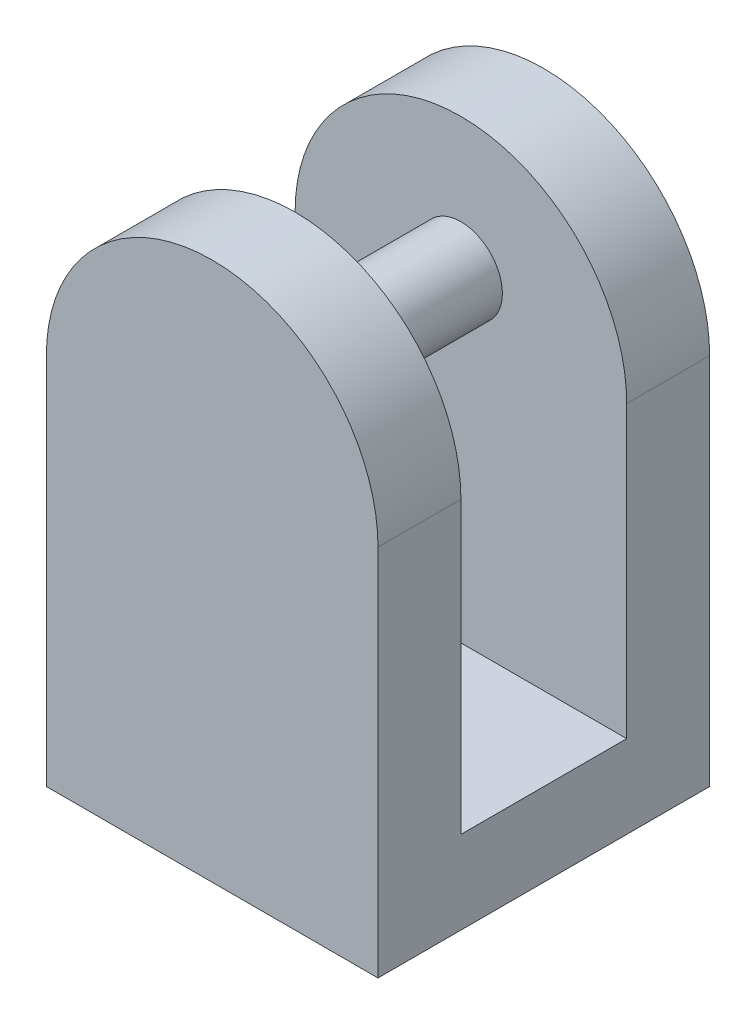
ISO-10303-21;
HEADER;
FILE_DESCRIPTION(('STEP AP214'),'2;1');
FILE_NAME('part.step','',(''),(''),'','','');
FILE_SCHEMA(('AUTOMOTIVE_DESIGN { 1 0 10303 214 1 1 1 1 }'));
ENDSEC;
DATA;
#1=APPLICATION_CONTEXT('core data for automotive mechanical design processes');
#2=APPLICATION_PROTOCOL_DEFINITION('international standard','automotive_design',2000,#1);
#3=PRODUCT_CONTEXT('',#1,'mechanical');
#4=PRODUCT('Part','Part','',(#3));
#5=PRODUCT_RELATED_PRODUCT_CATEGORY('part','',(#4));
#6=PRODUCT_DEFINITION_FORMATION('','',#4);
#7=PRODUCT_DEFINITION_CONTEXT('part definition',#1,'design');
#8=PRODUCT_DEFINITION('design','',#6,#7);
#9=PRODUCT_DEFINITION_SHAPE('','',#8);
#10=(LENGTH_UNIT() NAMED_UNIT(*) SI_UNIT(.MILLI.,.METRE.));
#11=(NAMED_UNIT(*) PLANE_ANGLE_UNIT() SI_UNIT($,.RADIAN.));
#12=(NAMED_UNIT(*) SI_UNIT($,.STERADIAN.) SOLID_ANGLE_UNIT());
#13=UNCERTAINTY_MEASURE_WITH_UNIT(LENGTH_MEASURE(1.E-05),#10,'distance_accuracy_value','');
#14=(GEOMETRIC_REPRESENTATION_CONTEXT(3) GLOBAL_UNCERTAINTY_ASSIGNED_CONTEXT((#13)) GLOBAL_UNIT_ASSIGNED_CONTEXT((#10,
#11,#12)) REPRESENTATION_CONTEXT('',''));
#15=CARTESIAN_POINT('',(0.,0.,0.));
#16=DIRECTION('',(0.,0.,1.));
#17=DIRECTION('',(1.,0.,0.));
#18=AXIS2_PLACEMENT_3D('',#15,#16,#17);
#19=CARTESIAN_POINT('',(0.,-5.,0.));
#20=DIRECTION('',(0.,1.,0.));
#21=DIRECTION('',(0.,0.,1.));
#22=AXIS2_PLACEMENT_3D('',#19,#20,#21);
#23=CYLINDRICAL_SURFACE('',#22,1.25);
#24=CARTESIAN_POINT('',(0.,0.,0.));
#25=DIRECTION('',(0.,1.,0.));
#26=DIRECTION('',(0.,0.,1.));
#27=AXIS2_PLACEMENT_3D('',#24,#25,#26);
#28=CIRCLE('',#27,1.25);
#29=CARTESIAN_POINT('',(0.,0.,1.25));
#30=VERTEX_POINT('',#29);
#31=EDGE_CURVE('E132',#30,#30,#28,.T.);
#32=ORIENTED_EDGE('',*,*,#31,.F.);
#33=EDGE_LOOP('',(#32));
#34=FACE_BOUND('',#33,.T.);
#35=CARTESIAN_POINT('',(0.,3.75,0.));
#36=DIRECTION('',(0.,1.,0.));
#37=DIRECTION('',(0.,0.,1.));
#38=AXIS2_PLACEMENT_3D('',#35,#36,#37);
#39=CIRCLE('',#38,1.25);
#40=CARTESIAN_POINT('',(0.,3.75,1.25));
#41=VERTEX_POINT('',#40);
#42=EDGE_CURVE('E43',#41,#41,#39,.F.);
#43=ORIENTED_EDGE('',*,*,#42,.F.);
#44=EDGE_LOOP('',(#43));
#45=FACE_BOUND('',#44,.T.);
#46=ADVANCED_FACE('F39',(#34,#45),#23,.F.);
#47=CARTESIAN_POINT('',(0.,22.5,10.));
#48=DIRECTION('',(0.,0.,-1.));
#49=DIRECTION('',(-1.,0.,0.));
#50=AXIS2_PLACEMENT_3D('',#47,#48,#49);
#51=CYLINDRICAL_SURFACE('',#50,10.);
#52=DIRECTION('',(0.,0.,-1.));
#53=VECTOR('',#52,1.);
#54=CARTESIAN_POINT('',(-10.,22.5,10.));
#55=LINE('',#54,#53);
#56=CARTESIAN_POINT('',(-10.,22.5,-5.));
#57=VERTEX_POINT('',#56);
#58=CARTESIAN_POINT('',(-10.,22.5,-10.));
#59=VERTEX_POINT('',#58);
#60=EDGE_CURVE('E179',#57,#59,#55,.T.);
#61=ORIENTED_EDGE('',*,*,#60,.F.);
#62=CARTESIAN_POINT('',(0.,22.5,-5.));
#63=DIRECTION('',(0.,0.,-1.));
#64=DIRECTION('',(-1.,0.,0.));
#65=AXIS2_PLACEMENT_3D('',#62,#63,#64);
#66=CIRCLE('',#65,10.);
#67=CARTESIAN_POINT('',(10.,22.5,-5.));
#68=VERTEX_POINT('',#67);
#69=EDGE_CURVE('E146',#57,#68,#66,.T.);
#70=ORIENTED_EDGE('',*,*,#69,.T.);
#71=DIRECTION('',(0.,0.,-1.));
#72=VECTOR('',#71,1.);
#73=CARTESIAN_POINT('',(9.99999999999999,22.5,10.));
#74=LINE('',#73,#72);
#75=CARTESIAN_POINT('',(9.99999999999999,22.5,-10.));
#76=VERTEX_POINT('',#75);
#77=EDGE_CURVE('E136',#68,#76,#74,.T.);
#78=ORIENTED_EDGE('',*,*,#77,.T.);
#79=CARTESIAN_POINT('',(0.,22.5,-10.));
#80=DIRECTION('',(0.,0.,1.));
#81=DIRECTION('',(-1.,0.,0.));
#82=AXIS2_PLACEMENT_3D('',#79,#80,#81);
#83=CIRCLE('',#82,10.);
#84=EDGE_CURVE('E171',#76,#59,#83,.T.);
#85=ORIENTED_EDGE('',*,*,#84,.T.);
#86=EDGE_LOOP('',(#61,#70,#78,#85));
#87=FACE_BOUND('',#86,.T.);
#88=ADVANCED_FACE('F211',(#87),#51,.T.);
#89=CARTESIAN_POINT('',(-10.,0.,10.));
#90=DIRECTION('',(0.,1.,0.));
#91=DIRECTION('',(0.,0.,1.));
#92=AXIS2_PLACEMENT_3D('',#89,#90,#91);
#93=PLANE('',#92);
#94=ORIENTED_EDGE('',*,*,#31,.T.);
#95=EDGE_LOOP('',(#94));
#96=FACE_BOUND('',#95,.T.);
#97=DIRECTION('',(1.,0.,0.));
#98=VECTOR('',#97,1.);
#99=CARTESIAN_POINT('',(-10.,0.,-10.));
#100=LINE('',#99,#98);
#101=CARTESIAN_POINT('',(-10.,0.,-10.));
#102=VERTEX_POINT('',#101);
#103=CARTESIAN_POINT('',(10.,0.,-10.));
#104=VERTEX_POINT('',#103);
#105=EDGE_CURVE('E153',#102,#104,#100,.T.);
#106=ORIENTED_EDGE('',*,*,#105,.T.);
#107=DIRECTION('',(0.,0.,-1.));
#108=VECTOR('',#107,1.);
#109=CARTESIAN_POINT('',(10.,0.,10.));
#110=LINE('',#109,#108);
#111=CARTESIAN_POINT('',(10.,0.,10.));
#112=VERTEX_POINT('',#111);
#113=EDGE_CURVE('E188',#112,#104,#110,.T.);
#114=ORIENTED_EDGE('',*,*,#113,.F.);
#115=DIRECTION('',(1.,0.,0.));
#116=VECTOR('',#115,1.);
#117=CARTESIAN_POINT('',(-10.,0.,10.));
#118=LINE('',#117,#116);
#119=CARTESIAN_POINT('',(-10.,0.,10.));
#120=VERTEX_POINT('',#119);
#121=EDGE_CURVE('E154',#120,#112,#118,.T.);
#122=ORIENTED_EDGE('',*,*,#121,.F.);
#123=DIRECTION('',(0.,0.,-1.));
#124=VECTOR('',#123,1.);
#125=CARTESIAN_POINT('',(-10.,0.,10.));
#126=LINE('',#125,#124);
#127=EDGE_CURVE('E164',#120,#102,#126,.T.);
#128=ORIENTED_EDGE('',*,*,#127,.T.);
#129=EDGE_LOOP('',(#106,#114,#122,#128));
#130=FACE_BOUND('',#129,.T.);
#131=ADVANCED_FACE('F41',(#96,#130),#93,.F.);
#132=CARTESIAN_POINT('',(10.,0.,10.));
#133=DIRECTION('',(-1.,0.,0.));
#134=DIRECTION('',(0.,-1.,0.));
#135=AXIS2_PLACEMENT_3D('',#132,#133,#134);
#136=PLANE('',#135);
#137=DIRECTION('',(0.,0.,-1.));
#138=VECTOR('',#137,1.);
#139=CARTESIAN_POINT('',(10.,5.,5.));
#140=LINE('',#139,#138);
#141=CARTESIAN_POINT('',(10.,5.,5.));
#142=VERTEX_POINT('',#141);
#143=CARTESIAN_POINT('',(10.,5.,-5.));
#144=VERTEX_POINT('',#143);
#145=EDGE_CURVE('E123',#142,#144,#140,.T.);
#146=ORIENTED_EDGE('',*,*,#145,.F.);
#147=DIRECTION('',(0.,1.,0.));
#148=VECTOR('',#147,1.);
#149=CARTESIAN_POINT('',(10.,5.,5.));
#150=LINE('',#149,#148);
#151=CARTESIAN_POINT('',(10.,22.5,5.));
#152=VERTEX_POINT('',#151);
#153=EDGE_CURVE('E150',#142,#152,#150,.T.);
#154=ORIENTED_EDGE('',*,*,#153,.T.);
#155=CARTESIAN_POINT('',(9.99999999999999,22.5,10.));
#156=VERTEX_POINT('',#155);
#157=EDGE_CURVE('E184',#156,#152,#74,.T.);
#158=ORIENTED_EDGE('',*,*,#157,.F.);
#159=DIRECTION('',(0.,1.,0.));
#160=VECTOR('',#159,1.);
#161=CARTESIAN_POINT('',(10.,0.,10.));
#162=LINE('',#161,#160);
#163=EDGE_CURVE('E93',#112,#156,#162,.T.);
#164=ORIENTED_EDGE('',*,*,#163,.F.);
#165=ORIENTED_EDGE('',*,*,#113,.T.);
#166=DIRECTION('',(0.,1.,0.));
#167=VECTOR('',#166,1.);
#168=CARTESIAN_POINT('',(10.,0.,-10.));
#169=LINE('',#168,#167);
#170=EDGE_CURVE('E168',#104,#76,#169,.T.);
#171=ORIENTED_EDGE('',*,*,#170,.T.);
#172=ORIENTED_EDGE('',*,*,#77,.F.);
#173=DIRECTION('',(0.,1.,0.));
#174=VECTOR('',#173,1.);
#175=CARTESIAN_POINT('',(10.,5.,-5.));
#176=LINE('',#175,#174);
#177=EDGE_CURVE('E116',#144,#68,#176,.T.);
#178=ORIENTED_EDGE('',*,*,#177,.F.);
#179=EDGE_LOOP('',(#146,#154,#158,#164,#165,#171,#172,#178));
#180=FACE_BOUND('',#179,.T.);
#181=ADVANCED_FACE('F134',(#180),#136,.F.);
#182=ORIENTED_EDGE('',*,*,#157,.T.);
#183=CARTESIAN_POINT('',(0.,22.5,5.));
#184=DIRECTION('',(0.,0.,1.));
#185=DIRECTION('',(1.,0.,0.));
#186=AXIS2_PLACEMENT_3D('',#183,#184,#185);
#187=CIRCLE('',#186,10.);
#188=CARTESIAN_POINT('',(-10.,22.5,5.));
#189=VERTEX_POINT('',#188);
#190=EDGE_CURVE('E149',#152,#189,#187,.T.);
#191=ORIENTED_EDGE('',*,*,#190,.T.);
#192=CARTESIAN_POINT('',(-10.,22.5,10.));
#193=VERTEX_POINT('',#192);
#194=EDGE_CURVE('E180',#193,#189,#55,.T.);
#195=ORIENTED_EDGE('',*,*,#194,.F.);
#196=CARTESIAN_POINT('',(0.,22.5,10.));
#197=DIRECTION('',(0.,0.,1.));
#198=DIRECTION('',(-1.,0.,0.));
#199=AXIS2_PLACEMENT_3D('',#196,#197,#198);
#200=CIRCLE('',#199,10.);
#201=EDGE_CURVE('E159',#156,#193,#200,.T.);
#202=ORIENTED_EDGE('',*,*,#201,.F.);
#203=EDGE_LOOP('',(#182,#191,#195,#202));
#204=FACE_BOUND('',#203,.T.);
#205=ADVANCED_FACE('F219',(#204),#51,.T.);
#206=CARTESIAN_POINT('',(-10.,22.5,10.));
#207=DIRECTION('',(1.,0.,0.));
#208=DIRECTION('',(0.,1.,0.));
#209=AXIS2_PLACEMENT_3D('',#206,#207,#208);
#210=PLANE('',#209);
#211=ORIENTED_EDGE('',*,*,#194,.T.);
#212=DIRECTION('',(0.,1.,0.));
#213=VECTOR('',#212,1.);
#214=CARTESIAN_POINT('',(-10.,5.,5.));
#215=LINE('',#214,#213);
#216=CARTESIAN_POINT('',(-10.,5.,5.));
#217=VERTEX_POINT('',#216);
#218=EDGE_CURVE('E141',#217,#189,#215,.T.);
#219=ORIENTED_EDGE('',*,*,#218,.F.);
#220=DIRECTION('',(0.,0.,1.));
#221=VECTOR('',#220,1.);
#222=CARTESIAN_POINT('',(-10.,5.,5.));
#223=LINE('',#222,#221);
#224=CARTESIAN_POINT('',(-10.,5.,-5.));
#225=VERTEX_POINT('',#224);
#226=EDGE_CURVE('E122',#225,#217,#223,.T.);
#227=ORIENTED_EDGE('',*,*,#226,.F.);
#228=DIRECTION('',(0.,1.,0.));
#229=VECTOR('',#228,1.);
#230=CARTESIAN_POINT('',(-10.,5.,-5.));
#231=LINE('',#230,#229);
#232=EDGE_CURVE('E119',#225,#57,#231,.T.);
#233=ORIENTED_EDGE('',*,*,#232,.T.);
#234=ORIENTED_EDGE('',*,*,#60,.T.);
#235=DIRECTION('',(0.,-1.,0.));
#236=VECTOR('',#235,1.);
#237=CARTESIAN_POINT('',(-10.,22.5,-10.));
#238=LINE('',#237,#236);
#239=EDGE_CURVE('E85',#59,#102,#238,.T.);
#240=ORIENTED_EDGE('',*,*,#239,.T.);
#241=ORIENTED_EDGE('',*,*,#127,.F.);
#242=DIRECTION('',(0.,-1.,0.));
#243=VECTOR('',#242,1.);
#244=CARTESIAN_POINT('',(-10.,22.5,10.));
#245=LINE('',#244,#243);
#246=EDGE_CURVE('E65',#193,#120,#245,.T.);
#247=ORIENTED_EDGE('',*,*,#246,.F.);
#248=EDGE_LOOP('',(#211,#219,#227,#233,#234,#240,#241,#247));
#249=FACE_BOUND('',#248,.T.);
#250=ADVANCED_FACE('F309',(#249),#210,.F.);
#251=CARTESIAN_POINT('',(0.,22.5,10.));
#252=DIRECTION('',(0.,0.,-1.));
#253=DIRECTION('',(-1.,0.,0.));
#254=AXIS2_PLACEMENT_3D('',#251,#252,#253);
#255=PLANE('',#254);
#256=ORIENTED_EDGE('',*,*,#121,.T.);
#257=ORIENTED_EDGE('',*,*,#163,.T.);
#258=ORIENTED_EDGE('',*,*,#201,.T.);
#259=ORIENTED_EDGE('',*,*,#246,.T.);
#260=EDGE_LOOP('',(#256,#257,#258,#259));
#261=FACE_BOUND('',#260,.T.);
#262=ADVANCED_FACE('F314',(#261),#255,.F.);
#263=CARTESIAN_POINT('',(0.,22.5,-10.));
#264=DIRECTION('',(0.,0.,-1.));
#265=DIRECTION('',(-1.,0.,0.));
#266=AXIS2_PLACEMENT_3D('',#263,#264,#265);
#267=PLANE('',#266);
#268=ORIENTED_EDGE('',*,*,#105,.F.);
#269=ORIENTED_EDGE('',*,*,#239,.F.);
#270=ORIENTED_EDGE('',*,*,#84,.F.);
#271=ORIENTED_EDGE('',*,*,#170,.F.);
#272=EDGE_LOOP('',(#268,#269,#270,#271));
#273=FACE_BOUND('',#272,.T.);
#274=ADVANCED_FACE('F206',(#273),#267,.T.);
#275=CARTESIAN_POINT('',(-10.,5.,5.));
#276=DIRECTION('',(0.,0.,1.));
#277=DIRECTION('',(1.,0.,0.));
#278=AXIS2_PLACEMENT_3D('',#275,#276,#277);
#279=PLANE('',#278);
#280=CARTESIAN_POINT('',(0.,24.5,5.));
#281=DIRECTION('',(0.,0.,1.));
#282=DIRECTION('',(1.,0.,0.));
#283=AXIS2_PLACEMENT_3D('',#280,#281,#282);
#284=CIRCLE('',#283,2.5);
#285=CARTESIAN_POINT('',(2.5,24.5,5.));
#286=VERTEX_POINT('',#285);
#287=EDGE_CURVE('E11',#286,#286,#284,.F.);
#288=ORIENTED_EDGE('',*,*,#287,.F.);
#289=EDGE_LOOP('',(#288));
#290=FACE_BOUND('',#289,.T.);
#291=ORIENTED_EDGE('',*,*,#153,.F.);
#292=DIRECTION('',(1.,0.,0.));
#293=VECTOR('',#292,1.);
#294=CARTESIAN_POINT('',(-10.,5.,5.));
#295=LINE('',#294,#293);
#296=EDGE_CURVE('E129',#217,#142,#295,.T.);
#297=ORIENTED_EDGE('',*,*,#296,.F.);
#298=ORIENTED_EDGE('',*,*,#218,.T.);
#299=ORIENTED_EDGE('',*,*,#190,.F.);
#300=EDGE_LOOP('',(#291,#297,#298,#299));
#301=FACE_BOUND('',#300,.T.);
#302=ADVANCED_FACE('F198',(#290,#301),#279,.F.);
#303=CARTESIAN_POINT('',(-10.,5.,-5.));
#304=DIRECTION('',(0.,0.,-1.));
#305=DIRECTION('',(-1.,0.,0.));
#306=AXIS2_PLACEMENT_3D('',#303,#304,#305);
#307=PLANE('',#306);
#308=CARTESIAN_POINT('',(0.,24.5,-5.));
#309=DIRECTION('',(0.,0.,-1.));
#310=DIRECTION('',(-1.,0.,0.));
#311=AXIS2_PLACEMENT_3D('',#308,#309,#310);
#312=CIRCLE('',#311,2.5);
#313=CARTESIAN_POINT('',(-2.5,24.5,-5.));
#314=VERTEX_POINT('',#313);
#315=EDGE_CURVE('E49',#314,#314,#312,.F.);
#316=ORIENTED_EDGE('',*,*,#315,.F.);
#317=EDGE_LOOP('',(#316));
#318=FACE_BOUND('',#317,.T.);
#319=ORIENTED_EDGE('',*,*,#232,.F.);
#320=DIRECTION('',(-1.,0.,0.));
#321=VECTOR('',#320,1.);
#322=CARTESIAN_POINT('',(-10.,5.,-5.));
#323=LINE('',#322,#321);
#324=EDGE_CURVE('E56',#144,#225,#323,.T.);
#325=ORIENTED_EDGE('',*,*,#324,.F.);
#326=ORIENTED_EDGE('',*,*,#177,.T.);
#327=ORIENTED_EDGE('',*,*,#69,.F.);
#328=EDGE_LOOP('',(#319,#325,#326,#327));
#329=FACE_BOUND('',#328,.T.);
#330=ADVANCED_FACE('F114',(#318,#329),#307,.F.);
#331=CARTESIAN_POINT('',(0.,5.,0.));
#332=DIRECTION('',(0.,-1.,0.));
#333=DIRECTION('',(0.,0.,-1.));
#334=AXIS2_PLACEMENT_3D('',#331,#332,#333);
#335=PLANE('',#334);
#336=CARTESIAN_POINT('',(0.,5.,0.));
#337=DIRECTION('',(0.,1.,0.));
#338=DIRECTION('',(0.,0.,1.));
#339=AXIS2_PLACEMENT_3D('',#336,#337,#338);
#340=CIRCLE('',#339,2.5);
#341=CARTESIAN_POINT('',(0.,5.,2.5));
#342=VERTEX_POINT('',#341);
#343=EDGE_CURVE('E246',#342,#342,#340,.T.);
#344=ORIENTED_EDGE('',*,*,#343,.F.);
#345=EDGE_LOOP('',(#344));
#346=FACE_BOUND('',#345,.T.);
#347=ORIENTED_EDGE('',*,*,#145,.T.);
#348=ORIENTED_EDGE('',*,*,#324,.T.);
#349=ORIENTED_EDGE('',*,*,#226,.T.);
#350=ORIENTED_EDGE('',*,*,#296,.T.);
#351=EDGE_LOOP('',(#347,#348,#349,#350));
#352=FACE_BOUND('',#351,.T.);
#353=ADVANCED_FACE('F127',(#346,#352),#335,.F.);
#354=CARTESIAN_POINT('',(0.,24.5,-12.0710678118655));
#355=DIRECTION('',(0.,0.,1.));
#356=DIRECTION('',(1.,0.,0.));
#357=AXIS2_PLACEMENT_3D('',#354,#355,#356);
#358=CYLINDRICAL_SURFACE('',#357,2.5);
#359=ORIENTED_EDGE('',*,*,#287,.T.);
#360=EDGE_LOOP('',(#359));
#361=FACE_BOUND('',#360,.T.);
#362=ORIENTED_EDGE('',*,*,#315,.T.);
#363=EDGE_LOOP('',(#362));
#364=FACE_BOUND('',#363,.T.);
#365=ADVANCED_FACE('F195',(#361,#364),#358,.T.);
#366=CARTESIAN_POINT('',(0.,3.75,0.));
#367=DIRECTION('',(0.,1.,0.));
#368=DIRECTION('',(0.,0.,1.));
#369=AXIS2_PLACEMENT_3D('',#366,#367,#368);
#370=PLANE('',#369);
#371=CARTESIAN_POINT('',(0.,3.75,0.));
#372=DIRECTION('',(0.,1.,0.));
#373=DIRECTION('',(0.,0.,1.));
#374=AXIS2_PLACEMENT_3D('',#371,#372,#373);
#375=CIRCLE('',#374,2.5);
#376=CARTESIAN_POINT('',(0.,3.75,2.5));
#377=VERTEX_POINT('',#376);
#378=EDGE_CURVE('E250',#377,#377,#375,.T.);
#379=ORIENTED_EDGE('',*,*,#378,.T.);
#380=EDGE_LOOP('',(#379));
#381=FACE_BOUND('',#380,.T.);
#382=ORIENTED_EDGE('',*,*,#42,.T.);
#383=EDGE_LOOP('',(#382));
#384=FACE_BOUND('',#383,.T.);
#385=ADVANCED_FACE('F227',(#381,#384),#370,.T.);
#386=CARTESIAN_POINT('',(0.,3.75,0.));
#387=DIRECTION('',(0.,1.,0.));
#388=DIRECTION('',(0.,0.,1.));
#389=AXIS2_PLACEMENT_3D('',#386,#387,#388);
#390=CYLINDRICAL_SURFACE('',#389,2.5);
#391=ORIENTED_EDGE('',*,*,#378,.F.);
#392=EDGE_LOOP('',(#391));
#393=FACE_BOUND('',#392,.T.);
#394=ORIENTED_EDGE('',*,*,#343,.T.);
#395=EDGE_LOOP('',(#394));
#396=FACE_BOUND('',#395,.T.);
#397=ADVANCED_FACE('F224',(#393,#396),#390,.F.);
#398=CLOSED_SHELL('',(#46,#88,#131,#181,#205,#250,#262,#274,#302,#330,#353,#365,#385,#397));
#399=MANIFOLD_SOLID_BREP('B2',#398);
#400=ADVANCED_BREP_SHAPE_REPRESENTATION('',(#18,#399),#14);
#401=SHAPE_DEFINITION_REPRESENTATION(#9,#400);
ENDSEC;
END-ISO-10303-21;
